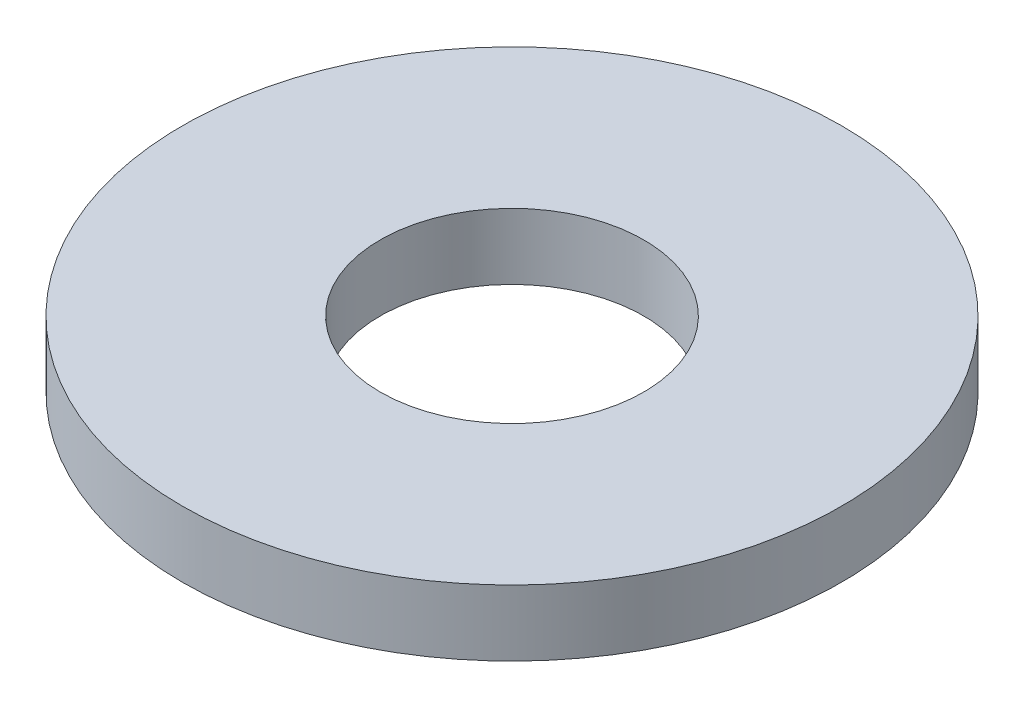
ISO-10303-21;
HEADER;
FILE_DESCRIPTION(('STEP AP214'),'2;1');
FILE_NAME('part.step','',(''),(''),'','','');
FILE_SCHEMA(('AUTOMOTIVE_DESIGN { 1 0 10303 214 1 1 1 1 }'));
ENDSEC;
DATA;
#1=APPLICATION_CONTEXT('core data for automotive mechanical design processes');
#2=APPLICATION_PROTOCOL_DEFINITION('international standard','automotive_design',2000,#1);
#3=PRODUCT_CONTEXT('',#1,'mechanical');
#4=PRODUCT('Part','Part','',(#3));
#5=PRODUCT_RELATED_PRODUCT_CATEGORY('part','',(#4));
#6=PRODUCT_DEFINITION_FORMATION('','',#4);
#7=PRODUCT_DEFINITION_CONTEXT('part definition',#1,'design');
#8=PRODUCT_DEFINITION('design','',#6,#7);
#9=PRODUCT_DEFINITION_SHAPE('','',#8);
#10=(LENGTH_UNIT() NAMED_UNIT(*) SI_UNIT(.MILLI.,.METRE.));
#11=(NAMED_UNIT(*) PLANE_ANGLE_UNIT() SI_UNIT($,.RADIAN.));
#12=(NAMED_UNIT(*) SI_UNIT($,.STERADIAN.) SOLID_ANGLE_UNIT());
#13=UNCERTAINTY_MEASURE_WITH_UNIT(LENGTH_MEASURE(1.E-05),#10,'distance_accuracy_value','');
#14=(GEOMETRIC_REPRESENTATION_CONTEXT(3) GLOBAL_UNCERTAINTY_ASSIGNED_CONTEXT((#13)) GLOBAL_UNIT_ASSIGNED_CONTEXT((#10,
#11,#12)) REPRESENTATION_CONTEXT('',''));
#15=CARTESIAN_POINT('',(0.,0.,0.));
#16=DIRECTION('',(0.,0.,1.));
#17=DIRECTION('',(1.,0.,0.));
#18=AXIS2_PLACEMENT_3D('',#15,#16,#17);
#19=CARTESIAN_POINT('',(0.,15.,0.));
#20=DIRECTION('',(0.,-1.,0.));
#21=DIRECTION('',(0.,0.,-1.));
#22=AXIS2_PLACEMENT_3D('',#19,#20,#21);
#23=CYLINDRICAL_SURFACE('',#22,75.);
#24=CARTESIAN_POINT('',(0.,15.,0.));
#25=DIRECTION('',(0.,1.,0.));
#26=DIRECTION('',(0.,0.,1.));
#27=AXIS2_PLACEMENT_3D('',#24,#25,#26);
#28=CIRCLE('',#27,75.);
#29=CARTESIAN_POINT('',(0.,15.,75.));
#30=VERTEX_POINT('',#29);
#31=EDGE_CURVE('E10',#30,#30,#28,.T.);
#32=ORIENTED_EDGE('',*,*,#31,.F.);
#33=EDGE_LOOP('',(#32));
#34=FACE_BOUND('',#33,.T.);
#35=CARTESIAN_POINT('',(0.,0.,0.));
#36=DIRECTION('',(0.,1.,0.));
#37=DIRECTION('',(0.,0.,1.));
#38=AXIS2_PLACEMENT_3D('',#35,#36,#37);
#39=CIRCLE('',#38,75.);
#40=CARTESIAN_POINT('',(0.,0.,75.));
#41=VERTEX_POINT('',#40);
#42=EDGE_CURVE('E37',#41,#41,#39,.T.);
#43=ORIENTED_EDGE('',*,*,#42,.T.);
#44=EDGE_LOOP('',(#43));
#45=FACE_BOUND('',#44,.T.);
#46=ADVANCED_FACE('F40',(#34,#45),#23,.T.);
#47=CARTESIAN_POINT('',(0.,15.,0.));
#48=DIRECTION('',(0.,1.,0.));
#49=DIRECTION('',(0.,0.,1.));
#50=AXIS2_PLACEMENT_3D('',#47,#48,#49);
#51=PLANE('',#50);
#52=CARTESIAN_POINT('',(0.,15.,0.));
#53=DIRECTION('',(0.,1.,0.));
#54=DIRECTION('',(0.,0.,1.));
#55=AXIS2_PLACEMENT_3D('',#52,#53,#54);
#56=CIRCLE('',#55,30.);
#57=CARTESIAN_POINT('',(0.,15.,30.));
#58=VERTEX_POINT('',#57);
#59=EDGE_CURVE('E50',#58,#58,#56,.T.);
#60=ORIENTED_EDGE('',*,*,#59,.F.);
#61=EDGE_LOOP('',(#60));
#62=FACE_BOUND('',#61,.T.);
#63=ORIENTED_EDGE('',*,*,#31,.T.);
#64=EDGE_LOOP('',(#63));
#65=FACE_BOUND('',#64,.T.);
#66=ADVANCED_FACE('F59',(#62,#65),#51,.T.);
#67=CARTESIAN_POINT('',(0.,0.,0.));
#68=DIRECTION('',(0.,1.,0.));
#69=DIRECTION('',(0.,0.,1.));
#70=AXIS2_PLACEMENT_3D('',#67,#68,#69);
#71=PLANE('',#70);
#72=CARTESIAN_POINT('',(0.,0.,0.));
#73=DIRECTION('',(0.,1.,0.));
#74=DIRECTION('',(0.,0.,1.));
#75=AXIS2_PLACEMENT_3D('',#72,#73,#74);
#76=CIRCLE('',#75,30.);
#77=CARTESIAN_POINT('',(0.,0.,30.));
#78=VERTEX_POINT('',#77);
#79=EDGE_CURVE('E47',#78,#78,#76,.T.);
#80=ORIENTED_EDGE('',*,*,#79,.T.);
#81=EDGE_LOOP('',(#80));
#82=FACE_BOUND('',#81,.T.);
#83=ORIENTED_EDGE('',*,*,#42,.F.);
#84=EDGE_LOOP('',(#83));
#85=FACE_BOUND('',#84,.T.);
#86=ADVANCED_FACE('F58',(#82,#85),#71,.F.);
#87=CARTESIAN_POINT('',(0.,15.,0.));
#88=DIRECTION('',(0.,-1.,0.));
#89=DIRECTION('',(0.,0.,-1.));
#90=AXIS2_PLACEMENT_3D('',#87,#88,#89);
#91=CYLINDRICAL_SURFACE('',#90,30.);
#92=ORIENTED_EDGE('',*,*,#59,.T.);
#93=EDGE_LOOP('',(#92));
#94=FACE_BOUND('',#93,.T.);
#95=ORIENTED_EDGE('',*,*,#79,.F.);
#96=EDGE_LOOP('',(#95));
#97=FACE_BOUND('',#96,.T.);
#98=ADVANCED_FACE('F54',(#94,#97),#91,.F.);
#99=CLOSED_SHELL('',(#46,#66,#86,#98));
#100=MANIFOLD_SOLID_BREP('B2',#99);
#101=ADVANCED_BREP_SHAPE_REPRESENTATION('',(#18,#100),#14);
#102=SHAPE_DEFINITION_REPRESENTATION(#9,#101);
ENDSEC;
END-ISO-10303-21;
